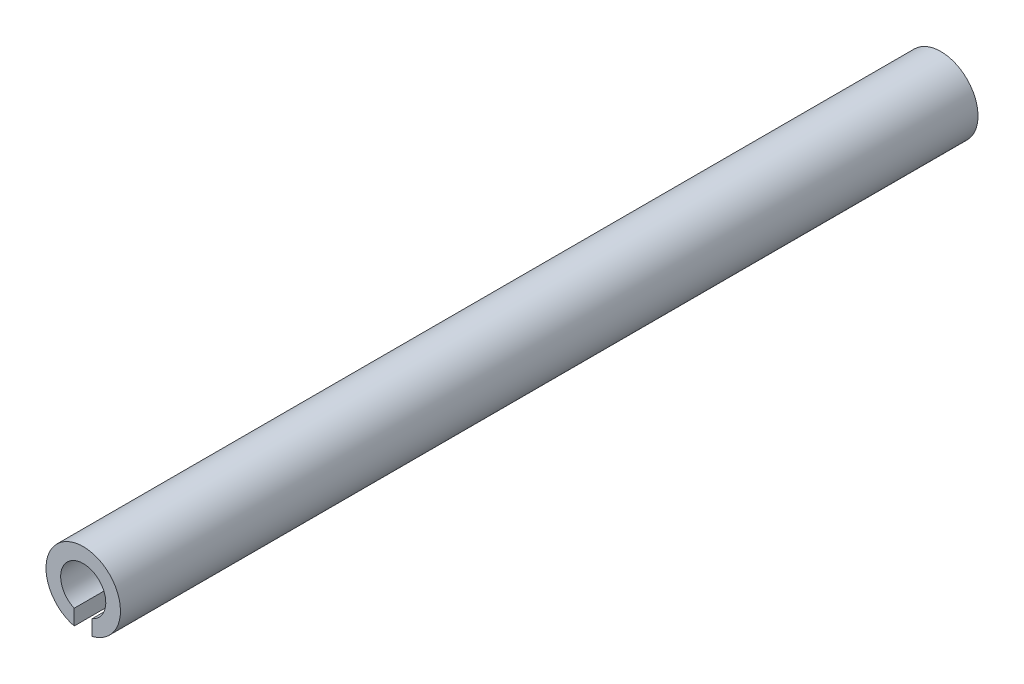
ISO-10303-21;
HEADER;
FILE_DESCRIPTION(('STEP AP214'),'2;1');
FILE_NAME('part.step','',(''),(''),'','','');
FILE_SCHEMA(('AUTOMOTIVE_DESIGN { 1 0 10303 214 1 1 1 1 }'));
ENDSEC;
DATA;
#1=APPLICATION_CONTEXT('core data for automotive mechanical design processes');
#2=APPLICATION_PROTOCOL_DEFINITION('international standard','automotive_design',2000,#1);
#3=PRODUCT_CONTEXT('',#1,'mechanical');
#4=PRODUCT('Part','Part','',(#3));
#5=PRODUCT_RELATED_PRODUCT_CATEGORY('part','',(#4));
#6=PRODUCT_DEFINITION_FORMATION('','',#4);
#7=PRODUCT_DEFINITION_CONTEXT('part definition',#1,'design');
#8=PRODUCT_DEFINITION('design','',#6,#7);
#9=PRODUCT_DEFINITION_SHAPE('','',#8);
#10=(LENGTH_UNIT() NAMED_UNIT(*) SI_UNIT(.MILLI.,.METRE.));
#11=(NAMED_UNIT(*) PLANE_ANGLE_UNIT() SI_UNIT($,.RADIAN.));
#12=(NAMED_UNIT(*) SI_UNIT($,.STERADIAN.) SOLID_ANGLE_UNIT());
#13=UNCERTAINTY_MEASURE_WITH_UNIT(LENGTH_MEASURE(1.E-05),#10,'distance_accuracy_value','');
#14=(GEOMETRIC_REPRESENTATION_CONTEXT(3) GLOBAL_UNCERTAINTY_ASSIGNED_CONTEXT((#13)) GLOBAL_UNIT_ASSIGNED_CONTEXT((#10,
#11,#12)) REPRESENTATION_CONTEXT('',''));
#15=CARTESIAN_POINT('',(0.,0.,0.));
#16=DIRECTION('',(0.,0.,1.));
#17=DIRECTION('',(1.,0.,0.));
#18=AXIS2_PLACEMENT_3D('',#15,#16,#17);
#19=CARTESIAN_POINT('',(0.,0.,38.));
#20=DIRECTION('',(0.,0.,-1.));
#21=DIRECTION('',(-1.,0.,0.));
#22=AXIS2_PLACEMENT_3D('',#19,#20,#21);
#23=CYLINDRICAL_SURFACE('',#22,1.);
#24=CARTESIAN_POINT('',(0.,0.,0.));
#25=DIRECTION('',(0.,0.,1.));
#26=DIRECTION('',(1.,0.,0.));
#27=AXIS2_PLACEMENT_3D('',#24,#25,#26);
#28=CIRCLE('',#27,1.);
#29=CARTESIAN_POINT('',(0.4,-0.916515138991168,0.));
#30=VERTEX_POINT('',#29);
#31=CARTESIAN_POINT('',(-0.4,-0.916515138991168,0.));
#32=VERTEX_POINT('',#31);
#33=EDGE_CURVE('E106',#30,#32,#28,.T.);
#34=ORIENTED_EDGE('',*,*,#33,.F.);
#35=DIRECTION('',(0.,0.,-1.));
#36=VECTOR('',#35,1.);
#37=CARTESIAN_POINT('',(0.4,-0.916515138991168,38.));
#38=LINE('',#37,#36);
#39=CARTESIAN_POINT('',(0.4,-0.916515138991168,38.));
#40=VERTEX_POINT('',#39);
#41=EDGE_CURVE('E11',#40,#30,#38,.T.);
#42=ORIENTED_EDGE('',*,*,#41,.F.);
#43=CARTESIAN_POINT('',(0.,0.,38.));
#44=DIRECTION('',(0.,0.,1.));
#45=DIRECTION('',(1.,0.,0.));
#46=AXIS2_PLACEMENT_3D('',#43,#44,#45);
#47=CIRCLE('',#46,1.);
#48=CARTESIAN_POINT('',(-0.4,-0.916515138991168,38.));
#49=VERTEX_POINT('',#48);
#50=EDGE_CURVE('E91',#40,#49,#47,.T.);
#51=ORIENTED_EDGE('',*,*,#50,.T.);
#52=DIRECTION('',(0.,0.,-1.));
#53=VECTOR('',#52,1.);
#54=CARTESIAN_POINT('',(-0.4,-0.916515138991168,38.));
#55=LINE('',#54,#53);
#56=EDGE_CURVE('E59',#49,#32,#55,.T.);
#57=ORIENTED_EDGE('',*,*,#56,.T.);
#58=EDGE_LOOP('',(#34,#42,#51,#57));
#59=FACE_BOUND('',#58,.T.);
#60=ADVANCED_FACE('F43',(#59),#23,.F.);
#61=CARTESIAN_POINT('',(0.4,0.,38.));
#62=DIRECTION('',(1.,0.,0.));
#63=DIRECTION('',(0.,1.,0.));
#64=AXIS2_PLACEMENT_3D('',#61,#62,#63);
#65=PLANE('',#64);
#66=DIRECTION('',(0.,-1.,0.));
#67=VECTOR('',#66,1.);
#68=CARTESIAN_POINT('',(0.4,0.,0.));
#69=LINE('',#68,#67);
#70=CARTESIAN_POINT('',(0.4,-1.60078105935821,0.));
#71=VERTEX_POINT('',#70);
#72=EDGE_CURVE('E97',#30,#71,#69,.T.);
#73=ORIENTED_EDGE('',*,*,#72,.T.);
#74=DIRECTION('',(0.,0.,-1.));
#75=VECTOR('',#74,1.);
#76=CARTESIAN_POINT('',(0.4,-1.60078105935821,38.));
#77=LINE('',#76,#75);
#78=CARTESIAN_POINT('',(0.4,-1.60078105935821,38.));
#79=VERTEX_POINT('',#78);
#80=EDGE_CURVE('E51',#79,#71,#77,.T.);
#81=ORIENTED_EDGE('',*,*,#80,.F.);
#82=DIRECTION('',(0.,-1.,0.));
#83=VECTOR('',#82,1.);
#84=CARTESIAN_POINT('',(0.4,0.,38.));
#85=LINE('',#84,#83);
#86=EDGE_CURVE('E85',#40,#79,#85,.T.);
#87=ORIENTED_EDGE('',*,*,#86,.F.);
#88=ORIENTED_EDGE('',*,*,#41,.T.);
#89=EDGE_LOOP('',(#73,#81,#87,#88));
#90=FACE_BOUND('',#89,.T.);
#91=ADVANCED_FACE('F95',(#90),#65,.F.);
#92=CARTESIAN_POINT('',(0.,0.,38.));
#93=DIRECTION('',(0.,0.,-1.));
#94=DIRECTION('',(-1.,0.,0.));
#95=AXIS2_PLACEMENT_3D('',#92,#93,#94);
#96=CYLINDRICAL_SURFACE('',#95,1.65);
#97=CARTESIAN_POINT('',(0.,0.,0.));
#98=DIRECTION('',(0.,0.,1.));
#99=DIRECTION('',(1.,0.,0.));
#100=AXIS2_PLACEMENT_3D('',#97,#98,#99);
#101=CIRCLE('',#100,1.65);
#102=CARTESIAN_POINT('',(-0.4,-1.60078105935821,0.));
#103=VERTEX_POINT('',#102);
#104=EDGE_CURVE('E109',#71,#103,#101,.T.);
#105=ORIENTED_EDGE('',*,*,#104,.T.);
#106=DIRECTION('',(0.,0.,-1.));
#107=VECTOR('',#106,1.);
#108=CARTESIAN_POINT('',(-0.4,-1.60078105935821,38.));
#109=LINE('',#108,#107);
#110=CARTESIAN_POINT('',(-0.4,-1.60078105935821,38.));
#111=VERTEX_POINT('',#110);
#112=EDGE_CURVE('E73',#111,#103,#109,.T.);
#113=ORIENTED_EDGE('',*,*,#112,.F.);
#114=CARTESIAN_POINT('',(0.,0.,38.));
#115=DIRECTION('',(0.,0.,1.));
#116=DIRECTION('',(1.,0.,0.));
#117=AXIS2_PLACEMENT_3D('',#114,#115,#116);
#118=CIRCLE('',#117,1.65);
#119=EDGE_CURVE('E90',#79,#111,#118,.T.);
#120=ORIENTED_EDGE('',*,*,#119,.F.);
#121=ORIENTED_EDGE('',*,*,#80,.T.);
#122=EDGE_LOOP('',(#105,#113,#120,#121));
#123=FACE_BOUND('',#122,.T.);
#124=ADVANCED_FACE('F100',(#123),#96,.T.);
#125=CARTESIAN_POINT('',(-0.4,0.,38.));
#126=DIRECTION('',(1.,0.,0.));
#127=DIRECTION('',(0.,1.,0.));
#128=AXIS2_PLACEMENT_3D('',#125,#126,#127);
#129=PLANE('',#128);
#130=DIRECTION('',(0.,-1.,0.));
#131=VECTOR('',#130,1.);
#132=CARTESIAN_POINT('',(-0.4,0.,0.));
#133=LINE('',#132,#131);
#134=EDGE_CURVE('E111',#32,#103,#133,.T.);
#135=ORIENTED_EDGE('',*,*,#134,.F.);
#136=ORIENTED_EDGE('',*,*,#56,.F.);
#137=DIRECTION('',(0.,-1.,0.));
#138=VECTOR('',#137,1.);
#139=CARTESIAN_POINT('',(-0.4,0.,38.));
#140=LINE('',#139,#138);
#141=EDGE_CURVE('E101',#49,#111,#140,.T.);
#142=ORIENTED_EDGE('',*,*,#141,.T.);
#143=ORIENTED_EDGE('',*,*,#112,.T.);
#144=EDGE_LOOP('',(#135,#136,#142,#143));
#145=FACE_BOUND('',#144,.T.);
#146=ADVANCED_FACE('F116',(#145),#129,.T.);
#147=CARTESIAN_POINT('',(0.,0.,38.));
#148=DIRECTION('',(0.,0.,1.));
#149=DIRECTION('',(1.,0.,0.));
#150=AXIS2_PLACEMENT_3D('',#147,#148,#149);
#151=PLANE('',#150);
#152=ORIENTED_EDGE('',*,*,#50,.F.);
#153=ORIENTED_EDGE('',*,*,#86,.T.);
#154=ORIENTED_EDGE('',*,*,#119,.T.);
#155=ORIENTED_EDGE('',*,*,#141,.F.);
#156=EDGE_LOOP('',(#152,#153,#154,#155));
#157=FACE_BOUND('',#156,.T.);
#158=ADVANCED_FACE('F87',(#157),#151,.T.);
#159=CARTESIAN_POINT('',(0.,0.,0.));
#160=DIRECTION('',(0.,0.,1.));
#161=DIRECTION('',(1.,0.,0.));
#162=AXIS2_PLACEMENT_3D('',#159,#160,#161);
#163=PLANE('',#162);
#164=ORIENTED_EDGE('',*,*,#33,.T.);
#165=ORIENTED_EDGE('',*,*,#134,.T.);
#166=ORIENTED_EDGE('',*,*,#104,.F.);
#167=ORIENTED_EDGE('',*,*,#72,.F.);
#168=EDGE_LOOP('',(#164,#165,#166,#167));
#169=FACE_BOUND('',#168,.T.);
#170=ADVANCED_FACE('F123',(#169),#163,.F.);
#171=CLOSED_SHELL('',(#60,#91,#124,#146,#158,#170));
#172=MANIFOLD_SOLID_BREP('B2',#171);
#173=ADVANCED_BREP_SHAPE_REPRESENTATION('',(#18,#172),#14);
#174=SHAPE_DEFINITION_REPRESENTATION(#9,#173);
ENDSEC;
END-ISO-10303-21;
